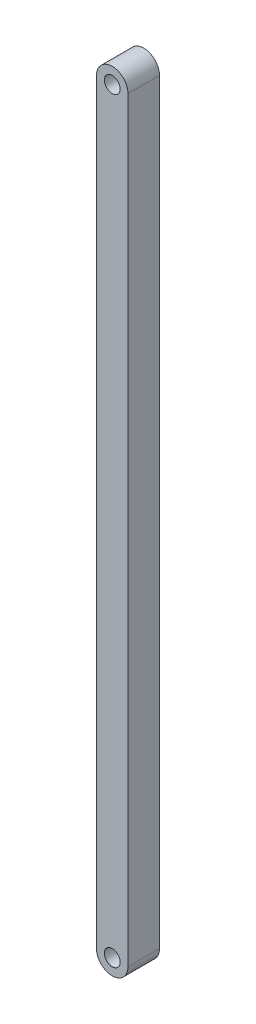
ISO-10303-21;
HEADER;
FILE_DESCRIPTION(('STEP AP214'),'2;1');
FILE_NAME('part.step','',(''),(''),'','','');
FILE_SCHEMA(('AUTOMOTIVE_DESIGN { 1 0 10303 214 1 1 1 1 }'));
ENDSEC;
DATA;
#1=APPLICATION_CONTEXT('core data for automotive mechanical design processes');
#2=APPLICATION_PROTOCOL_DEFINITION('international standard','automotive_design',2000,#1);
#3=PRODUCT_CONTEXT('',#1,'mechanical');
#4=PRODUCT('Part','Part','',(#3));
#5=PRODUCT_RELATED_PRODUCT_CATEGORY('part','',(#4));
#6=PRODUCT_DEFINITION_FORMATION('','',#4);
#7=PRODUCT_DEFINITION_CONTEXT('part definition',#1,'design');
#8=PRODUCT_DEFINITION('design','',#6,#7);
#9=PRODUCT_DEFINITION_SHAPE('','',#8);
#10=(LENGTH_UNIT() NAMED_UNIT(*) SI_UNIT(.MILLI.,.METRE.));
#11=(NAMED_UNIT(*) PLANE_ANGLE_UNIT() SI_UNIT($,.RADIAN.));
#12=(NAMED_UNIT(*) SI_UNIT($,.STERADIAN.) SOLID_ANGLE_UNIT());
#13=UNCERTAINTY_MEASURE_WITH_UNIT(LENGTH_MEASURE(1.E-05),#10,'distance_accuracy_value','');
#14=(GEOMETRIC_REPRESENTATION_CONTEXT(3) GLOBAL_UNCERTAINTY_ASSIGNED_CONTEXT((#13)) GLOBAL_UNIT_ASSIGNED_CONTEXT((#10,
#11,#12)) REPRESENTATION_CONTEXT('',''));
#15=CARTESIAN_POINT('',(0.,0.,0.));
#16=DIRECTION('',(0.,0.,1.));
#17=DIRECTION('',(1.,0.,0.));
#18=AXIS2_PLACEMENT_3D('',#15,#16,#17);
#19=CARTESIAN_POINT('',(9.99999999999999,0.,20.));
#20=DIRECTION('',(0.,0.,-1.));
#21=DIRECTION('',(-1.,0.,0.));
#22=AXIS2_PLACEMENT_3D('',#19,#20,#21);
#23=PLANE('',#22);
#24=CARTESIAN_POINT('',(9.99999999999999,0.,20.));
#25=DIRECTION('',(0.,0.,1.));
#26=DIRECTION('',(-1.,0.,0.));
#27=AXIS2_PLACEMENT_3D('',#24,#25,#26);
#28=CIRCLE('',#27,9.99999999999999);
#29=CARTESIAN_POINT('',(0.,0.,20.));
#30=VERTEX_POINT('',#29);
#31=CARTESIAN_POINT('',(20.,0.,20.));
#32=VERTEX_POINT('',#31);
#33=EDGE_CURVE('E84',#30,#32,#28,.T.);
#34=ORIENTED_EDGE('',*,*,#33,.T.);
#35=DIRECTION('',(0.,1.,0.));
#36=VECTOR('',#35,1.);
#37=CARTESIAN_POINT('',(20.,480.,20.));
#38=LINE('',#37,#36);
#39=CARTESIAN_POINT('',(20.,480.,20.));
#40=VERTEX_POINT('',#39);
#41=EDGE_CURVE('E79',#32,#40,#38,.T.);
#42=ORIENTED_EDGE('',*,*,#41,.T.);
#43=CARTESIAN_POINT('',(9.99999999999999,480.,20.));
#44=DIRECTION('',(0.,0.,1.));
#45=DIRECTION('',(-1.,0.,0.));
#46=AXIS2_PLACEMENT_3D('',#43,#44,#45);
#47=CIRCLE('',#46,9.99999999999999);
#48=CARTESIAN_POINT('',(0.,480.,20.));
#49=VERTEX_POINT('',#48);
#50=EDGE_CURVE('E82',#40,#49,#47,.T.);
#51=ORIENTED_EDGE('',*,*,#50,.T.);
#52=DIRECTION('',(0.,-1.,0.));
#53=VECTOR('',#52,1.);
#54=CARTESIAN_POINT('',(0.,0.,20.));
#55=LINE('',#54,#53);
#56=EDGE_CURVE('E49',#49,#30,#55,.T.);
#57=ORIENTED_EDGE('',*,*,#56,.T.);
#58=EDGE_LOOP('',(#34,#42,#51,#57));
#59=FACE_BOUND('',#58,.T.);
#60=CARTESIAN_POINT('',(9.99999999999999,0.,20.));
#61=DIRECTION('',(0.,0.,1.));
#62=DIRECTION('',(1.,0.,0.));
#63=AXIS2_PLACEMENT_3D('',#60,#61,#62);
#64=CIRCLE('',#63,5.025);
#65=CARTESIAN_POINT('',(15.025,0.,20.));
#66=VERTEX_POINT('',#65);
#67=EDGE_CURVE('E115',#66,#66,#64,.T.);
#68=ORIENTED_EDGE('',*,*,#67,.F.);
#69=EDGE_LOOP('',(#68));
#70=FACE_BOUND('',#69,.T.);
#71=CARTESIAN_POINT('',(9.99999999999999,480.,20.));
#72=DIRECTION('',(0.,0.,1.));
#73=DIRECTION('',(1.,0.,0.));
#74=AXIS2_PLACEMENT_3D('',#71,#72,#73);
#75=CIRCLE('',#74,5.025);
#76=CARTESIAN_POINT('',(15.025,480.,20.));
#77=VERTEX_POINT('',#76);
#78=EDGE_CURVE('E124',#77,#77,#75,.T.);
#79=ORIENTED_EDGE('',*,*,#78,.F.);
#80=EDGE_LOOP('',(#79));
#81=FACE_BOUND('',#80,.T.);
#82=ADVANCED_FACE('F32',(#59,#70,#81),#23,.F.);
#83=CARTESIAN_POINT('',(9.99999999999999,0.,20.));
#84=DIRECTION('',(0.,0.,-1.));
#85=DIRECTION('',(-1.,0.,0.));
#86=AXIS2_PLACEMENT_3D('',#83,#84,#85);
#87=CYLINDRICAL_SURFACE('',#86,9.99999999999999);
#88=CARTESIAN_POINT('',(9.99999999999999,0.,0.));
#89=DIRECTION('',(0.,0.,1.));
#90=DIRECTION('',(-1.,0.,0.));
#91=AXIS2_PLACEMENT_3D('',#88,#89,#90);
#92=CIRCLE('',#91,9.99999999999999);
#93=CARTESIAN_POINT('',(0.,0.,0.));
#94=VERTEX_POINT('',#93);
#95=CARTESIAN_POINT('',(20.,0.,0.));
#96=VERTEX_POINT('',#95);
#97=EDGE_CURVE('E96',#94,#96,#92,.T.);
#98=ORIENTED_EDGE('',*,*,#97,.T.);
#99=DIRECTION('',(0.,0.,-1.));
#100=VECTOR('',#99,1.);
#101=CARTESIAN_POINT('',(20.,0.,20.));
#102=LINE('',#101,#100);
#103=EDGE_CURVE('E11',#32,#96,#102,.T.);
#104=ORIENTED_EDGE('',*,*,#103,.F.);
#105=ORIENTED_EDGE('',*,*,#33,.F.);
#106=DIRECTION('',(0.,0.,-1.));
#107=VECTOR('',#106,1.);
#108=CARTESIAN_POINT('',(0.,0.,20.));
#109=LINE('',#108,#107);
#110=EDGE_CURVE('E92',#30,#94,#109,.T.);
#111=ORIENTED_EDGE('',*,*,#110,.T.);
#112=EDGE_LOOP('',(#98,#104,#105,#111));
#113=FACE_BOUND('',#112,.T.);
#114=ADVANCED_FACE('F34',(#113),#87,.T.);
#115=CARTESIAN_POINT('',(20.,480.,20.));
#116=DIRECTION('',(-1.,0.,0.));
#117=DIRECTION('',(0.,0.,1.));
#118=AXIS2_PLACEMENT_3D('',#115,#116,#117);
#119=PLANE('',#118);
#120=DIRECTION('',(0.,1.,0.));
#121=VECTOR('',#120,1.);
#122=CARTESIAN_POINT('',(20.,480.,0.));
#123=LINE('',#122,#121);
#124=CARTESIAN_POINT('',(20.,480.,0.));
#125=VERTEX_POINT('',#124);
#126=EDGE_CURVE('E88',#96,#125,#123,.T.);
#127=ORIENTED_EDGE('',*,*,#126,.T.);
#128=DIRECTION('',(0.,0.,-1.));
#129=VECTOR('',#128,1.);
#130=CARTESIAN_POINT('',(20.,480.,20.));
#131=LINE('',#130,#129);
#132=EDGE_CURVE('E41',#40,#125,#131,.T.);
#133=ORIENTED_EDGE('',*,*,#132,.F.);
#134=ORIENTED_EDGE('',*,*,#41,.F.);
#135=ORIENTED_EDGE('',*,*,#103,.T.);
#136=EDGE_LOOP('',(#127,#133,#134,#135));
#137=FACE_BOUND('',#136,.T.);
#138=ADVANCED_FACE('F87',(#137),#119,.F.);
#139=CARTESIAN_POINT('',(9.99999999999999,480.,20.));
#140=DIRECTION('',(0.,0.,-1.));
#141=DIRECTION('',(-1.,0.,0.));
#142=AXIS2_PLACEMENT_3D('',#139,#140,#141);
#143=CYLINDRICAL_SURFACE('',#142,9.99999999999999);
#144=CARTESIAN_POINT('',(9.99999999999999,480.,0.));
#145=DIRECTION('',(0.,0.,1.));
#146=DIRECTION('',(-1.,0.,0.));
#147=AXIS2_PLACEMENT_3D('',#144,#145,#146);
#148=CIRCLE('',#147,9.99999999999999);
#149=CARTESIAN_POINT('',(0.,480.,0.));
#150=VERTEX_POINT('',#149);
#151=EDGE_CURVE('E66',#125,#150,#148,.T.);
#152=ORIENTED_EDGE('',*,*,#151,.T.);
#153=DIRECTION('',(0.,0.,-1.));
#154=VECTOR('',#153,1.);
#155=CARTESIAN_POINT('',(0.,480.,20.));
#156=LINE('',#155,#154);
#157=EDGE_CURVE('E89',#49,#150,#156,.T.);
#158=ORIENTED_EDGE('',*,*,#157,.F.);
#159=ORIENTED_EDGE('',*,*,#50,.F.);
#160=ORIENTED_EDGE('',*,*,#132,.T.);
#161=EDGE_LOOP('',(#152,#158,#159,#160));
#162=FACE_BOUND('',#161,.T.);
#163=ADVANCED_FACE('F90',(#162),#143,.T.);
#164=CARTESIAN_POINT('',(0.,0.,20.));
#165=DIRECTION('',(1.,0.,0.));
#166=DIRECTION('',(0.,0.,-1.));
#167=AXIS2_PLACEMENT_3D('',#164,#165,#166);
#168=PLANE('',#167);
#169=DIRECTION('',(0.,-1.,0.));
#170=VECTOR('',#169,1.);
#171=CARTESIAN_POINT('',(0.,0.,0.));
#172=LINE('',#171,#170);
#173=EDGE_CURVE('E72',#150,#94,#172,.T.);
#174=ORIENTED_EDGE('',*,*,#173,.T.);
#175=ORIENTED_EDGE('',*,*,#110,.F.);
#176=ORIENTED_EDGE('',*,*,#56,.F.);
#177=ORIENTED_EDGE('',*,*,#157,.T.);
#178=EDGE_LOOP('',(#174,#175,#176,#177));
#179=FACE_BOUND('',#178,.T.);
#180=ADVANCED_FACE('F104',(#179),#168,.F.);
#181=CARTESIAN_POINT('',(9.99999999999999,0.,0.));
#182=DIRECTION('',(0.,0.,-1.));
#183=DIRECTION('',(-1.,0.,0.));
#184=AXIS2_PLACEMENT_3D('',#181,#182,#183);
#185=PLANE('',#184);
#186=CARTESIAN_POINT('',(9.99999999999999,480.,0.));
#187=DIRECTION('',(0.,0.,-1.));
#188=DIRECTION('',(-1.,0.,0.));
#189=AXIS2_PLACEMENT_3D('',#186,#187,#188);
#190=CIRCLE('',#189,4.99999999999994);
#191=CARTESIAN_POINT('',(5.00000000000006,480.,0.));
#192=VERTEX_POINT('',#191);
#193=EDGE_CURVE('E118',#192,#192,#190,.T.);
#194=ORIENTED_EDGE('',*,*,#193,.F.);
#195=EDGE_LOOP('',(#194));
#196=FACE_BOUND('',#195,.T.);
#197=CARTESIAN_POINT('',(9.99999999999999,0.,0.));
#198=DIRECTION('',(0.,0.,-1.));
#199=DIRECTION('',(-1.,0.,0.));
#200=AXIS2_PLACEMENT_3D('',#197,#198,#199);
#201=CIRCLE('',#200,4.99999999999994);
#202=CARTESIAN_POINT('',(5.00000000000006,0.,0.));
#203=VERTEX_POINT('',#202);
#204=EDGE_CURVE('E99',#203,#203,#201,.T.);
#205=ORIENTED_EDGE('',*,*,#204,.F.);
#206=EDGE_LOOP('',(#205));
#207=FACE_BOUND('',#206,.T.);
#208=ORIENTED_EDGE('',*,*,#97,.F.);
#209=ORIENTED_EDGE('',*,*,#173,.F.);
#210=ORIENTED_EDGE('',*,*,#151,.F.);
#211=ORIENTED_EDGE('',*,*,#126,.F.);
#212=EDGE_LOOP('',(#208,#209,#210,#211));
#213=FACE_BOUND('',#212,.T.);
#214=ADVANCED_FACE('F107',(#196,#207,#213),#185,.T.);
#215=CARTESIAN_POINT('',(9.99999999999999,0.,20.));
#216=DIRECTION('',(0.,0.,1.));
#217=DIRECTION('',(1.,0.,0.));
#218=AXIS2_PLACEMENT_3D('',#215,#216,#217);
#219=CYLINDRICAL_SURFACE('',#218,4.99999999999994);
#220=CARTESIAN_POINT('',(9.99999999999999,0.,19.9749999999998));
#221=DIRECTION('',(0.,0.,1.));
#222=DIRECTION('',(1.,0.,0.));
#223=AXIS2_PLACEMENT_3D('',#220,#221,#222);
#224=CIRCLE('',#223,4.99999999999988);
#225=CARTESIAN_POINT('',(14.9999999999999,0.,19.9749999999998));
#226=VERTEX_POINT('',#225);
#227=EDGE_CURVE('E112',#226,#226,#224,.T.);
#228=ORIENTED_EDGE('',*,*,#227,.T.);
#229=EDGE_LOOP('',(#228));
#230=FACE_BOUND('',#229,.T.);
#231=ORIENTED_EDGE('',*,*,#204,.T.);
#232=EDGE_LOOP('',(#231));
#233=FACE_BOUND('',#232,.T.);
#234=ADVANCED_FACE('F137',(#230,#233),#219,.F.);
#235=CARTESIAN_POINT('',(9.99999999999999,0.,20.));
#236=DIRECTION('',(0.,0.,1.));
#237=DIRECTION('',(1.,0.,0.));
#238=AXIS2_PLACEMENT_3D('',#235,#236,#237);
#239=CONICAL_SURFACE('',#238,5.025,0.785398163396581);
#240=ORIENTED_EDGE('',*,*,#227,.F.);
#241=EDGE_LOOP('',(#240));
#242=FACE_BOUND('',#241,.T.);
#243=ORIENTED_EDGE('',*,*,#67,.T.);
#244=EDGE_LOOP('',(#243));
#245=FACE_BOUND('',#244,.T.);
#246=ADVANCED_FACE('F168',(#242,#245),#239,.F.);
#247=CARTESIAN_POINT('',(9.99999999999999,480.,20.));
#248=DIRECTION('',(0.,0.,1.));
#249=DIRECTION('',(1.,0.,0.));
#250=AXIS2_PLACEMENT_3D('',#247,#248,#249);
#251=CYLINDRICAL_SURFACE('',#250,4.99999999999994);
#252=CARTESIAN_POINT('',(9.99999999999999,480.,19.9749999999998));
#253=DIRECTION('',(0.,0.,1.));
#254=DIRECTION('',(1.,0.,0.));
#255=AXIS2_PLACEMENT_3D('',#252,#253,#254);
#256=CIRCLE('',#255,4.99999999999988);
#257=CARTESIAN_POINT('',(14.9999999999999,480.,19.9749999999998));
#258=VERTEX_POINT('',#257);
#259=EDGE_CURVE('E121',#258,#258,#256,.T.);
#260=ORIENTED_EDGE('',*,*,#259,.T.);
#261=EDGE_LOOP('',(#260));
#262=FACE_BOUND('',#261,.T.);
#263=ORIENTED_EDGE('',*,*,#193,.T.);
#264=EDGE_LOOP('',(#263));
#265=FACE_BOUND('',#264,.T.);
#266=ADVANCED_FACE('F175',(#262,#265),#251,.F.);
#267=CARTESIAN_POINT('',(9.99999999999999,480.,20.));
#268=DIRECTION('',(0.,0.,1.));
#269=DIRECTION('',(1.,0.,0.));
#270=AXIS2_PLACEMENT_3D('',#267,#268,#269);
#271=CONICAL_SURFACE('',#270,5.025,0.785398163396581);
#272=ORIENTED_EDGE('',*,*,#259,.F.);
#273=EDGE_LOOP('',(#272));
#274=FACE_BOUND('',#273,.T.);
#275=ORIENTED_EDGE('',*,*,#78,.T.);
#276=EDGE_LOOP('',(#275));
#277=FACE_BOUND('',#276,.T.);
#278=ADVANCED_FACE('F128',(#274,#277),#271,.F.);
#279=CLOSED_SHELL('',(#82,#114,#138,#163,#180,#214,#234,#246,#266,#278));
#280=MANIFOLD_SOLID_BREP('B2',#279);
#281=ADVANCED_BREP_SHAPE_REPRESENTATION('',(#18,#280),#14);
#282=SHAPE_DEFINITION_REPRESENTATION(#9,#281);
ENDSEC;
END-ISO-10303-21;
